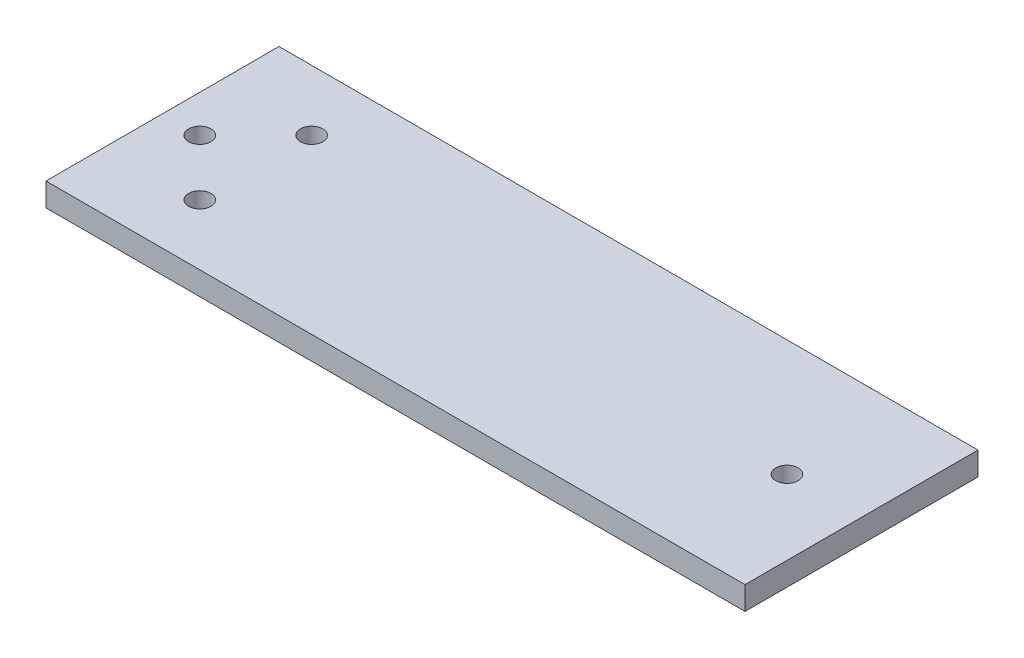
ISO-10303-21;
HEADER;
FILE_DESCRIPTION(('STEP AP214'),'2;1');
FILE_NAME('part.step','',(''),(''),'','','');
FILE_SCHEMA(('AUTOMOTIVE_DESIGN { 1 0 10303 214 1 1 1 1 }'));
ENDSEC;
DATA;
#1=APPLICATION_CONTEXT('core data for automotive mechanical design processes');
#2=APPLICATION_PROTOCOL_DEFINITION('international standard','automotive_design',2000,#1);
#3=PRODUCT_CONTEXT('',#1,'mechanical');
#4=PRODUCT('Part','Part','',(#3));
#5=PRODUCT_RELATED_PRODUCT_CATEGORY('part','',(#4));
#6=PRODUCT_DEFINITION_FORMATION('','',#4);
#7=PRODUCT_DEFINITION_CONTEXT('part definition',#1,'design');
#8=PRODUCT_DEFINITION('design','',#6,#7);
#9=PRODUCT_DEFINITION_SHAPE('','',#8);
#10=(LENGTH_UNIT() NAMED_UNIT(*) SI_UNIT(.MILLI.,.METRE.));
#11=(NAMED_UNIT(*) PLANE_ANGLE_UNIT() SI_UNIT($,.RADIAN.));
#12=(NAMED_UNIT(*) SI_UNIT($,.STERADIAN.) SOLID_ANGLE_UNIT());
#13=UNCERTAINTY_MEASURE_WITH_UNIT(LENGTH_MEASURE(1.E-05),#10,'distance_accuracy_value','');
#14=(GEOMETRIC_REPRESENTATION_CONTEXT(3) GLOBAL_UNCERTAINTY_ASSIGNED_CONTEXT((#13)) GLOBAL_UNIT_ASSIGNED_CONTEXT((#10,
#11,#12)) REPRESENTATION_CONTEXT('',''));
#15=CARTESIAN_POINT('',(0.,0.,0.));
#16=DIRECTION('',(0.,0.,1.));
#17=DIRECTION('',(1.,0.,0.));
#18=AXIS2_PLACEMENT_3D('',#15,#16,#17);
#19=CARTESIAN_POINT('',(37.5,2.5,12.5));
#20=DIRECTION('',(-1.,0.,0.));
#21=DIRECTION('',(0.,0.,1.));
#22=AXIS2_PLACEMENT_3D('',#19,#20,#21);
#23=PLANE('',#22);
#24=DIRECTION('',(0.,0.,-1.));
#25=VECTOR('',#24,1.);
#26=CARTESIAN_POINT('',(37.5,0.,12.5));
#27=LINE('',#26,#25);
#28=CARTESIAN_POINT('',(37.5,0.,12.5));
#29=VERTEX_POINT('',#28);
#30=CARTESIAN_POINT('',(37.5,0.,-12.5));
#31=VERTEX_POINT('',#30);
#32=EDGE_CURVE('E96',#29,#31,#27,.T.);
#33=ORIENTED_EDGE('',*,*,#32,.T.);
#34=DIRECTION('',(0.,-1.,0.));
#35=VECTOR('',#34,1.);
#36=CARTESIAN_POINT('',(37.5,2.5,-12.5));
#37=LINE('',#36,#35);
#38=CARTESIAN_POINT('',(37.5,2.5,-12.5));
#39=VERTEX_POINT('',#38);
#40=EDGE_CURVE('E11',#39,#31,#37,.T.);
#41=ORIENTED_EDGE('',*,*,#40,.F.);
#42=DIRECTION('',(0.,0.,-1.));
#43=VECTOR('',#42,1.);
#44=CARTESIAN_POINT('',(37.5,2.5,12.5));
#45=LINE('',#44,#43);
#46=CARTESIAN_POINT('',(37.5,2.5,12.5));
#47=VERTEX_POINT('',#46);
#48=EDGE_CURVE('E84',#47,#39,#45,.T.);
#49=ORIENTED_EDGE('',*,*,#48,.F.);
#50=DIRECTION('',(0.,-1.,0.));
#51=VECTOR('',#50,1.);
#52=CARTESIAN_POINT('',(37.5,2.5,12.5));
#53=LINE('',#52,#51);
#54=EDGE_CURVE('E92',#47,#29,#53,.T.);
#55=ORIENTED_EDGE('',*,*,#54,.T.);
#56=EDGE_LOOP('',(#33,#41,#49,#55));
#57=FACE_BOUND('',#56,.T.);
#58=ADVANCED_FACE('F33',(#57),#23,.F.);
#59=CARTESIAN_POINT('',(-37.5,2.5,-12.5));
#60=DIRECTION('',(0.,0.,1.));
#61=DIRECTION('',(1.,0.,0.));
#62=AXIS2_PLACEMENT_3D('',#59,#60,#61);
#63=PLANE('',#62);
#64=DIRECTION('',(-1.,0.,0.));
#65=VECTOR('',#64,1.);
#66=CARTESIAN_POINT('',(-37.5,0.,-12.5));
#67=LINE('',#66,#65);
#68=CARTESIAN_POINT('',(-37.5,0.,-12.5));
#69=VERTEX_POINT('',#68);
#70=EDGE_CURVE('E88',#31,#69,#67,.T.);
#71=ORIENTED_EDGE('',*,*,#70,.T.);
#72=DIRECTION('',(0.,-1.,0.));
#73=VECTOR('',#72,1.);
#74=CARTESIAN_POINT('',(-37.5,2.5,-12.5));
#75=LINE('',#74,#73);
#76=CARTESIAN_POINT('',(-37.5,2.5,-12.5));
#77=VERTEX_POINT('',#76);
#78=EDGE_CURVE('E41',#77,#69,#75,.T.);
#79=ORIENTED_EDGE('',*,*,#78,.F.);
#80=DIRECTION('',(-1.,0.,0.));
#81=VECTOR('',#80,1.);
#82=CARTESIAN_POINT('',(-37.5,2.5,-12.5));
#83=LINE('',#82,#81);
#84=EDGE_CURVE('E79',#39,#77,#83,.T.);
#85=ORIENTED_EDGE('',*,*,#84,.F.);
#86=ORIENTED_EDGE('',*,*,#40,.T.);
#87=EDGE_LOOP('',(#71,#79,#85,#86));
#88=FACE_BOUND('',#87,.T.);
#89=ADVANCED_FACE('F87',(#88),#63,.F.);
#90=CARTESIAN_POINT('',(-37.5,2.5,12.5));
#91=DIRECTION('',(1.,0.,0.));
#92=DIRECTION('',(0.,0.,-1.));
#93=AXIS2_PLACEMENT_3D('',#90,#91,#92);
#94=PLANE('',#93);
#95=DIRECTION('',(0.,0.,1.));
#96=VECTOR('',#95,1.);
#97=CARTESIAN_POINT('',(-37.5,0.,12.5));
#98=LINE('',#97,#96);
#99=CARTESIAN_POINT('',(-37.5,0.,12.5));
#100=VERTEX_POINT('',#99);
#101=EDGE_CURVE('E66',#69,#100,#98,.T.);
#102=ORIENTED_EDGE('',*,*,#101,.T.);
#103=DIRECTION('',(0.,-1.,0.));
#104=VECTOR('',#103,1.);
#105=CARTESIAN_POINT('',(-37.5,2.5,12.5));
#106=LINE('',#105,#104);
#107=CARTESIAN_POINT('',(-37.5,2.5,12.5));
#108=VERTEX_POINT('',#107);
#109=EDGE_CURVE('E89',#108,#100,#106,.T.);
#110=ORIENTED_EDGE('',*,*,#109,.F.);
#111=DIRECTION('',(0.,0.,1.));
#112=VECTOR('',#111,1.);
#113=CARTESIAN_POINT('',(-37.5,2.5,12.5));
#114=LINE('',#113,#112);
#115=EDGE_CURVE('E82',#77,#108,#114,.T.);
#116=ORIENTED_EDGE('',*,*,#115,.F.);
#117=ORIENTED_EDGE('',*,*,#78,.T.);
#118=EDGE_LOOP('',(#102,#110,#116,#117));
#119=FACE_BOUND('',#118,.T.);
#120=ADVANCED_FACE('F90',(#119),#94,.F.);
#121=CARTESIAN_POINT('',(-37.5,2.5,12.5));
#122=DIRECTION('',(0.,0.,-1.));
#123=DIRECTION('',(-1.,0.,0.));
#124=AXIS2_PLACEMENT_3D('',#121,#122,#123);
#125=PLANE('',#124);
#126=DIRECTION('',(1.,0.,0.));
#127=VECTOR('',#126,1.);
#128=CARTESIAN_POINT('',(-37.5,0.,12.5));
#129=LINE('',#128,#127);
#130=EDGE_CURVE('E72',#100,#29,#129,.T.);
#131=ORIENTED_EDGE('',*,*,#130,.T.);
#132=ORIENTED_EDGE('',*,*,#54,.F.);
#133=DIRECTION('',(1.,0.,0.));
#134=VECTOR('',#133,1.);
#135=CARTESIAN_POINT('',(-37.5,2.5,12.5));
#136=LINE('',#135,#134);
#137=EDGE_CURVE('E49',#108,#47,#136,.T.);
#138=ORIENTED_EDGE('',*,*,#137,.F.);
#139=ORIENTED_EDGE('',*,*,#109,.T.);
#140=EDGE_LOOP('',(#131,#132,#138,#139));
#141=FACE_BOUND('',#140,.T.);
#142=ADVANCED_FACE('F104',(#141),#125,.F.);
#143=CARTESIAN_POINT('',(0.,2.5,0.));
#144=DIRECTION('',(0.,-1.,0.));
#145=DIRECTION('',(0.,0.,-1.));
#146=AXIS2_PLACEMENT_3D('',#143,#144,#145);
#147=PLANE('',#146);
#148=CARTESIAN_POINT('',(-27.5,2.5,-6.));
#149=DIRECTION('',(0.,1.,0.));
#150=DIRECTION('',(0.,0.,1.));
#151=AXIS2_PLACEMENT_3D('',#148,#149,#150);
#152=CIRCLE('',#151,1.2);
#153=CARTESIAN_POINT('',(-27.5,2.5,-4.8));
#154=VERTEX_POINT('',#153);
#155=EDGE_CURVE('E128',#154,#154,#152,.T.);
#156=ORIENTED_EDGE('',*,*,#155,.F.);
#157=EDGE_LOOP('',(#156));
#158=FACE_BOUND('',#157,.T.);
#159=CARTESIAN_POINT('',(-27.5,2.5,6.));
#160=DIRECTION('',(0.,1.,0.));
#161=DIRECTION('',(0.,0.,1.));
#162=AXIS2_PLACEMENT_3D('',#159,#160,#161);
#163=CIRCLE('',#162,1.2);
#164=CARTESIAN_POINT('',(-27.5,2.5,7.2));
#165=VERTEX_POINT('',#164);
#166=EDGE_CURVE('E122',#165,#165,#163,.T.);
#167=ORIENTED_EDGE('',*,*,#166,.F.);
#168=EDGE_LOOP('',(#167));
#169=FACE_BOUND('',#168,.T.);
#170=CARTESIAN_POINT('',(29.5,2.5,0.));
#171=DIRECTION('',(0.,1.,0.));
#172=DIRECTION('',(0.,0.,1.));
#173=AXIS2_PLACEMENT_3D('',#170,#171,#172);
#174=CIRCLE('',#173,1.2);
#175=CARTESIAN_POINT('',(29.5,2.5,1.2));
#176=VERTEX_POINT('',#175);
#177=EDGE_CURVE('E116',#176,#176,#174,.T.);
#178=ORIENTED_EDGE('',*,*,#177,.F.);
#179=EDGE_LOOP('',(#178));
#180=FACE_BOUND('',#179,.T.);
#181=CARTESIAN_POINT('',(-33.5,2.5,0.));
#182=DIRECTION('',(0.,1.,0.));
#183=DIRECTION('',(0.,0.,1.));
#184=AXIS2_PLACEMENT_3D('',#181,#182,#183);
#185=CIRCLE('',#184,1.2);
#186=CARTESIAN_POINT('',(-33.5,2.5,1.2));
#187=VERTEX_POINT('',#186);
#188=EDGE_CURVE('E110',#187,#187,#185,.T.);
#189=ORIENTED_EDGE('',*,*,#188,.F.);
#190=EDGE_LOOP('',(#189));
#191=FACE_BOUND('',#190,.T.);
#192=ORIENTED_EDGE('',*,*,#48,.T.);
#193=ORIENTED_EDGE('',*,*,#84,.T.);
#194=ORIENTED_EDGE('',*,*,#115,.T.);
#195=ORIENTED_EDGE('',*,*,#137,.T.);
#196=EDGE_LOOP('',(#192,#193,#194,#195));
#197=FACE_BOUND('',#196,.T.);
#198=ADVANCED_FACE('F80',(#158,#169,#180,#191,#197),#147,.F.);
#199=CARTESIAN_POINT('',(0.,0.,0.));
#200=DIRECTION('',(0.,-1.,0.));
#201=DIRECTION('',(0.,0.,-1.));
#202=AXIS2_PLACEMENT_3D('',#199,#200,#201);
#203=PLANE('',#202);
#204=CARTESIAN_POINT('',(-27.5,0.,-6.));
#205=DIRECTION('',(0.,1.,0.));
#206=DIRECTION('',(0.,0.,1.));
#207=AXIS2_PLACEMENT_3D('',#204,#205,#206);
#208=CIRCLE('',#207,1.2);
#209=CARTESIAN_POINT('',(-27.5,0.,-4.8));
#210=VERTEX_POINT('',#209);
#211=EDGE_CURVE('E113',#210,#210,#208,.T.);
#212=ORIENTED_EDGE('',*,*,#211,.T.);
#213=EDGE_LOOP('',(#212));
#214=FACE_BOUND('',#213,.T.);
#215=CARTESIAN_POINT('',(-27.5,0.,6.));
#216=DIRECTION('',(0.,1.,0.));
#217=DIRECTION('',(0.,0.,1.));
#218=AXIS2_PLACEMENT_3D('',#215,#216,#217);
#219=CIRCLE('',#218,1.2);
#220=CARTESIAN_POINT('',(-27.5,0.,7.2));
#221=VERTEX_POINT('',#220);
#222=EDGE_CURVE('E125',#221,#221,#219,.T.);
#223=ORIENTED_EDGE('',*,*,#222,.T.);
#224=EDGE_LOOP('',(#223));
#225=FACE_BOUND('',#224,.T.);
#226=CARTESIAN_POINT('',(29.5,0.,0.));
#227=DIRECTION('',(0.,1.,0.));
#228=DIRECTION('',(0.,0.,1.));
#229=AXIS2_PLACEMENT_3D('',#226,#227,#228);
#230=CIRCLE('',#229,1.2);
#231=CARTESIAN_POINT('',(29.5,0.,1.2));
#232=VERTEX_POINT('',#231);
#233=EDGE_CURVE('E119',#232,#232,#230,.T.);
#234=ORIENTED_EDGE('',*,*,#233,.T.);
#235=EDGE_LOOP('',(#234));
#236=FACE_BOUND('',#235,.T.);
#237=CARTESIAN_POINT('',(-33.5,0.,0.));
#238=DIRECTION('',(0.,1.,0.));
#239=DIRECTION('',(0.,0.,1.));
#240=AXIS2_PLACEMENT_3D('',#237,#238,#239);
#241=CIRCLE('',#240,1.2);
#242=CARTESIAN_POINT('',(-33.5,0.,1.2));
#243=VERTEX_POINT('',#242);
#244=EDGE_CURVE('E99',#243,#243,#241,.T.);
#245=ORIENTED_EDGE('',*,*,#244,.T.);
#246=EDGE_LOOP('',(#245));
#247=FACE_BOUND('',#246,.T.);
#248=ORIENTED_EDGE('',*,*,#32,.F.);
#249=ORIENTED_EDGE('',*,*,#130,.F.);
#250=ORIENTED_EDGE('',*,*,#101,.F.);
#251=ORIENTED_EDGE('',*,*,#70,.F.);
#252=EDGE_LOOP('',(#248,#249,#250,#251));
#253=FACE_BOUND('',#252,.T.);
#254=ADVANCED_FACE('F107',(#214,#225,#236,#247,#253),#203,.T.);
#255=CARTESIAN_POINT('',(-33.5,0.,0.));
#256=DIRECTION('',(0.,1.,0.));
#257=DIRECTION('',(0.,0.,1.));
#258=AXIS2_PLACEMENT_3D('',#255,#256,#257);
#259=CYLINDRICAL_SURFACE('',#258,1.2);
#260=ORIENTED_EDGE('',*,*,#244,.F.);
#261=EDGE_LOOP('',(#260));
#262=FACE_BOUND('',#261,.T.);
#263=ORIENTED_EDGE('',*,*,#188,.T.);
#264=EDGE_LOOP('',(#263));
#265=FACE_BOUND('',#264,.T.);
#266=ADVANCED_FACE('F152',(#262,#265),#259,.F.);
#267=CARTESIAN_POINT('',(29.5,0.,0.));
#268=DIRECTION('',(0.,1.,0.));
#269=DIRECTION('',(0.,0.,1.));
#270=AXIS2_PLACEMENT_3D('',#267,#268,#269);
#271=CYLINDRICAL_SURFACE('',#270,1.2);
#272=ORIENTED_EDGE('',*,*,#233,.F.);
#273=EDGE_LOOP('',(#272));
#274=FACE_BOUND('',#273,.T.);
#275=ORIENTED_EDGE('',*,*,#177,.T.);
#276=EDGE_LOOP('',(#275));
#277=FACE_BOUND('',#276,.T.);
#278=ADVANCED_FACE('F154',(#274,#277),#271,.F.);
#279=CARTESIAN_POINT('',(-27.5,0.,6.));
#280=DIRECTION('',(0.,1.,0.));
#281=DIRECTION('',(0.,0.,1.));
#282=AXIS2_PLACEMENT_3D('',#279,#280,#281);
#283=CYLINDRICAL_SURFACE('',#282,1.2);
#284=ORIENTED_EDGE('',*,*,#222,.F.);
#285=EDGE_LOOP('',(#284));
#286=FACE_BOUND('',#285,.T.);
#287=ORIENTED_EDGE('',*,*,#166,.T.);
#288=EDGE_LOOP('',(#287));
#289=FACE_BOUND('',#288,.T.);
#290=ADVANCED_FACE('F139',(#286,#289),#283,.F.);
#291=CARTESIAN_POINT('',(-27.5,0.,-6.));
#292=DIRECTION('',(0.,1.,0.));
#293=DIRECTION('',(0.,0.,1.));
#294=AXIS2_PLACEMENT_3D('',#291,#292,#293);
#295=CYLINDRICAL_SURFACE('',#294,1.2);
#296=ORIENTED_EDGE('',*,*,#211,.F.);
#297=EDGE_LOOP('',(#296));
#298=FACE_BOUND('',#297,.T.);
#299=ORIENTED_EDGE('',*,*,#155,.T.);
#300=EDGE_LOOP('',(#299));
#301=FACE_BOUND('',#300,.T.);
#302=ADVANCED_FACE('F136',(#298,#301),#295,.F.);
#303=CLOSED_SHELL('',(#58,#89,#120,#142,#198,#254,#266,#278,#290,#302));
#304=MANIFOLD_SOLID_BREP('B2',#303);
#305=ADVANCED_BREP_SHAPE_REPRESENTATION('',(#18,#304),#14);
#306=SHAPE_DEFINITION_REPRESENTATION(#9,#305);
ENDSEC;
END-ISO-10303-21;
